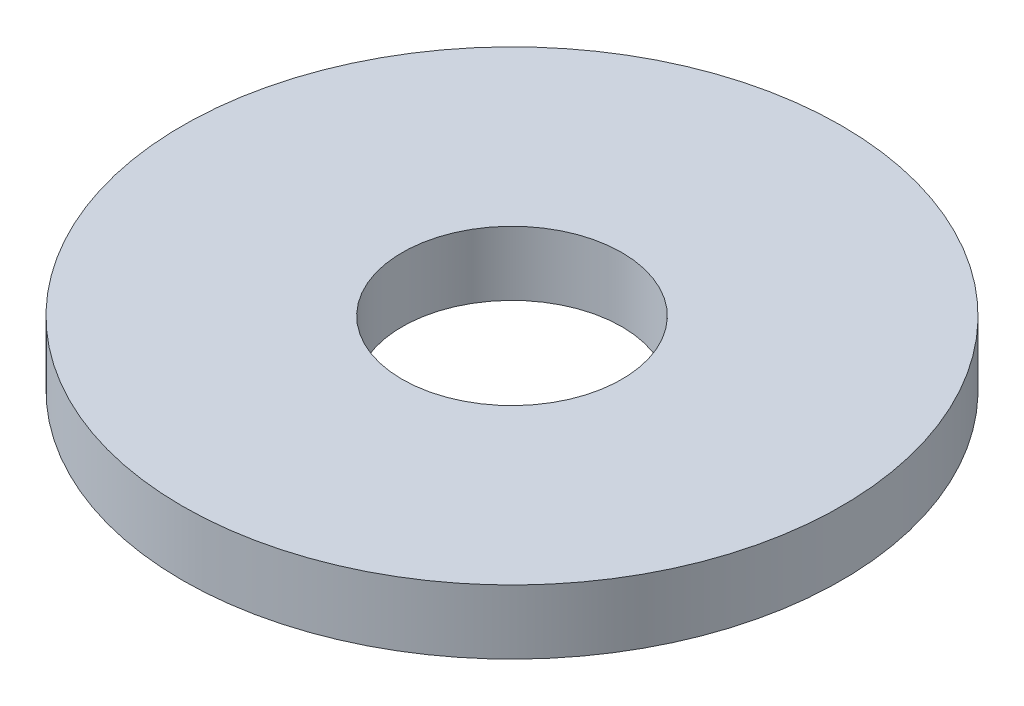
ISO-10303-21;
HEADER;
FILE_DESCRIPTION(('STEP AP214'),'2;1');
FILE_NAME('part.step','',(''),(''),'','','');
FILE_SCHEMA(('AUTOMOTIVE_DESIGN { 1 0 10303 214 1 1 1 1 }'));
ENDSEC;
DATA;
#1=APPLICATION_CONTEXT('core data for automotive mechanical design processes');
#2=APPLICATION_PROTOCOL_DEFINITION('international standard','automotive_design',2000,#1);
#3=PRODUCT_CONTEXT('',#1,'mechanical');
#4=PRODUCT('Part','Part','',(#3));
#5=PRODUCT_RELATED_PRODUCT_CATEGORY('part','',(#4));
#6=PRODUCT_DEFINITION_FORMATION('','',#4);
#7=PRODUCT_DEFINITION_CONTEXT('part definition',#1,'design');
#8=PRODUCT_DEFINITION('design','',#6,#7);
#9=PRODUCT_DEFINITION_SHAPE('','',#8);
#10=(LENGTH_UNIT() NAMED_UNIT(*) SI_UNIT(.MILLI.,.METRE.));
#11=(NAMED_UNIT(*) PLANE_ANGLE_UNIT() SI_UNIT($,.RADIAN.));
#12=(NAMED_UNIT(*) SI_UNIT($,.STERADIAN.) SOLID_ANGLE_UNIT());
#13=UNCERTAINTY_MEASURE_WITH_UNIT(LENGTH_MEASURE(1.E-05),#10,'distance_accuracy_value','');
#14=(GEOMETRIC_REPRESENTATION_CONTEXT(3) GLOBAL_UNCERTAINTY_ASSIGNED_CONTEXT((#13)) GLOBAL_UNIT_ASSIGNED_CONTEXT((#10,
#11,#12)) REPRESENTATION_CONTEXT('',''));
#15=CARTESIAN_POINT('',(0.,0.,0.));
#16=DIRECTION('',(0.,0.,1.));
#17=DIRECTION('',(1.,0.,0.));
#18=AXIS2_PLACEMENT_3D('',#15,#16,#17);
#19=CARTESIAN_POINT('',(0.,19.,0.));
#20=DIRECTION('',(0.,-1.,0.));
#21=DIRECTION('',(0.,0.,-1.));
#22=AXIS2_PLACEMENT_3D('',#19,#20,#21);
#23=CYLINDRICAL_SURFACE('',#22,97.5);
#24=CARTESIAN_POINT('',(0.,19.,0.));
#25=DIRECTION('',(0.,1.,0.));
#26=DIRECTION('',(0.,0.,1.));
#27=AXIS2_PLACEMENT_3D('',#24,#25,#26);
#28=CIRCLE('',#27,97.5);
#29=CARTESIAN_POINT('',(0.,19.,97.5));
#30=VERTEX_POINT('',#29);
#31=EDGE_CURVE('E10',#30,#30,#28,.T.);
#32=ORIENTED_EDGE('',*,*,#31,.F.);
#33=EDGE_LOOP('',(#32));
#34=FACE_BOUND('',#33,.T.);
#35=CARTESIAN_POINT('',(0.,0.,0.));
#36=DIRECTION('',(0.,1.,0.));
#37=DIRECTION('',(0.,0.,1.));
#38=AXIS2_PLACEMENT_3D('',#35,#36,#37);
#39=CIRCLE('',#38,97.5);
#40=CARTESIAN_POINT('',(0.,0.,97.5));
#41=VERTEX_POINT('',#40);
#42=EDGE_CURVE('E37',#41,#41,#39,.T.);
#43=ORIENTED_EDGE('',*,*,#42,.T.);
#44=EDGE_LOOP('',(#43));
#45=FACE_BOUND('',#44,.T.);
#46=ADVANCED_FACE('F40',(#34,#45),#23,.T.);
#47=CARTESIAN_POINT('',(0.,19.,0.));
#48=DIRECTION('',(0.,1.,0.));
#49=DIRECTION('',(0.,0.,1.));
#50=AXIS2_PLACEMENT_3D('',#47,#48,#49);
#51=PLANE('',#50);
#52=CARTESIAN_POINT('',(0.,19.,0.));
#53=DIRECTION('',(0.,1.,0.));
#54=DIRECTION('',(0.,0.,1.));
#55=AXIS2_PLACEMENT_3D('',#52,#53,#54);
#56=CIRCLE('',#55,32.5);
#57=CARTESIAN_POINT('',(0.,19.,32.5));
#58=VERTEX_POINT('',#57);
#59=EDGE_CURVE('E50',#58,#58,#56,.T.);
#60=ORIENTED_EDGE('',*,*,#59,.F.);
#61=EDGE_LOOP('',(#60));
#62=FACE_BOUND('',#61,.T.);
#63=ORIENTED_EDGE('',*,*,#31,.T.);
#64=EDGE_LOOP('',(#63));
#65=FACE_BOUND('',#64,.T.);
#66=ADVANCED_FACE('F59',(#62,#65),#51,.T.);
#67=CARTESIAN_POINT('',(0.,0.,0.));
#68=DIRECTION('',(0.,1.,0.));
#69=DIRECTION('',(0.,0.,1.));
#70=AXIS2_PLACEMENT_3D('',#67,#68,#69);
#71=PLANE('',#70);
#72=CARTESIAN_POINT('',(0.,0.,0.));
#73=DIRECTION('',(0.,1.,0.));
#74=DIRECTION('',(0.,0.,1.));
#75=AXIS2_PLACEMENT_3D('',#72,#73,#74);
#76=CIRCLE('',#75,32.5);
#77=CARTESIAN_POINT('',(0.,0.,32.5));
#78=VERTEX_POINT('',#77);
#79=EDGE_CURVE('E47',#78,#78,#76,.T.);
#80=ORIENTED_EDGE('',*,*,#79,.T.);
#81=EDGE_LOOP('',(#80));
#82=FACE_BOUND('',#81,.T.);
#83=ORIENTED_EDGE('',*,*,#42,.F.);
#84=EDGE_LOOP('',(#83));
#85=FACE_BOUND('',#84,.T.);
#86=ADVANCED_FACE('F58',(#82,#85),#71,.F.);
#87=CARTESIAN_POINT('',(0.,19.,0.));
#88=DIRECTION('',(0.,-1.,0.));
#89=DIRECTION('',(0.,0.,-1.));
#90=AXIS2_PLACEMENT_3D('',#87,#88,#89);
#91=CYLINDRICAL_SURFACE('',#90,32.5);
#92=ORIENTED_EDGE('',*,*,#59,.T.);
#93=EDGE_LOOP('',(#92));
#94=FACE_BOUND('',#93,.T.);
#95=ORIENTED_EDGE('',*,*,#79,.F.);
#96=EDGE_LOOP('',(#95));
#97=FACE_BOUND('',#96,.T.);
#98=ADVANCED_FACE('F54',(#94,#97),#91,.F.);
#99=CLOSED_SHELL('',(#46,#66,#86,#98));
#100=MANIFOLD_SOLID_BREP('B2',#99);
#101=ADVANCED_BREP_SHAPE_REPRESENTATION('',(#18,#100),#14);
#102=SHAPE_DEFINITION_REPRESENTATION(#9,#101);
ENDSEC;
END-ISO-10303-21;
